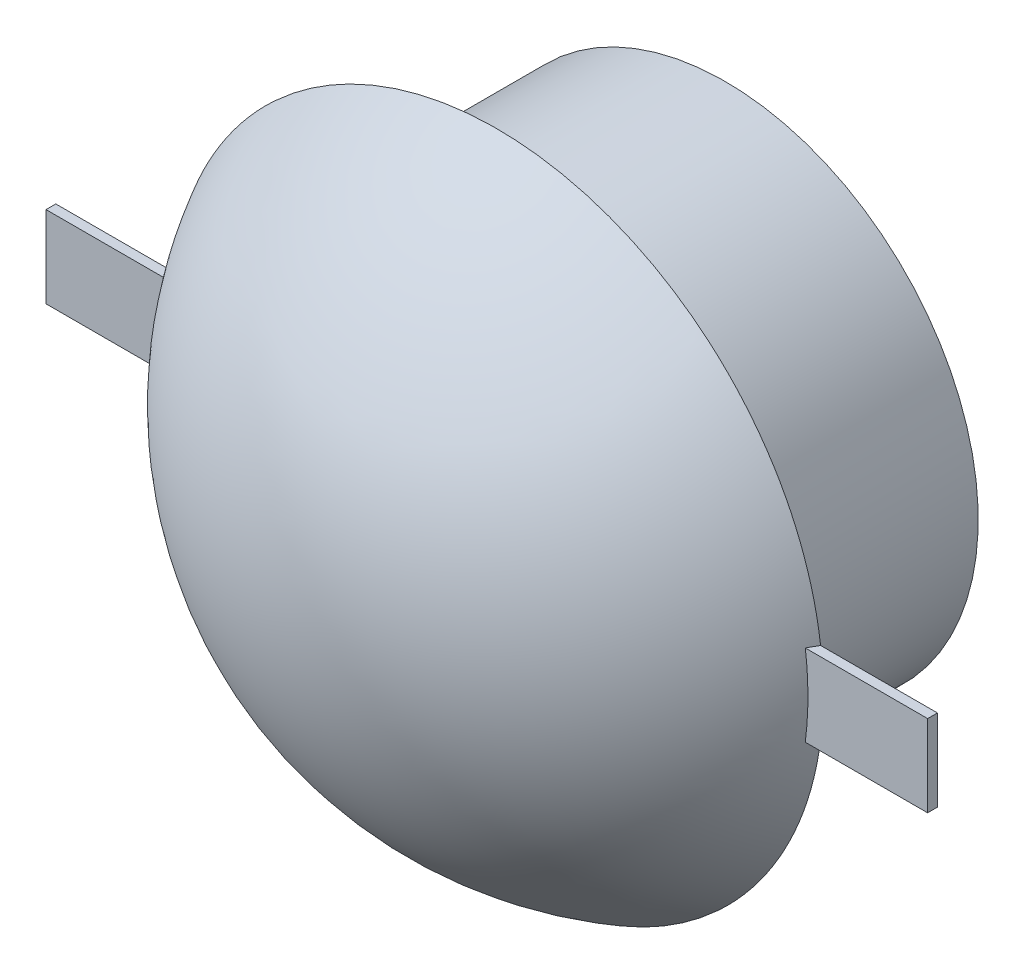
ISO-10303-21;
HEADER;
FILE_DESCRIPTION(('STEP AP214'),'2;1');
FILE_NAME('part.step','',(''),(''),'','','');
FILE_SCHEMA(('AUTOMOTIVE_DESIGN { 1 0 10303 214 1 1 1 1 }'));
ENDSEC;
DATA;
#1=APPLICATION_CONTEXT('core data for automotive mechanical design processes');
#2=APPLICATION_PROTOCOL_DEFINITION('international standard','automotive_design',2000,#1);
#3=PRODUCT_CONTEXT('',#1,'mechanical');
#4=PRODUCT('Part','Part','',(#3));
#5=PRODUCT_RELATED_PRODUCT_CATEGORY('part','',(#4));
#6=PRODUCT_DEFINITION_FORMATION('','',#4);
#7=PRODUCT_DEFINITION_CONTEXT('part definition',#1,'design');
#8=PRODUCT_DEFINITION('design','',#6,#7);
#9=PRODUCT_DEFINITION_SHAPE('','',#8);
#10=(LENGTH_UNIT() NAMED_UNIT(*) SI_UNIT(.MILLI.,.METRE.));
#11=(NAMED_UNIT(*) PLANE_ANGLE_UNIT() SI_UNIT($,.RADIAN.));
#12=(NAMED_UNIT(*) SI_UNIT($,.STERADIAN.) SOLID_ANGLE_UNIT());
#13=UNCERTAINTY_MEASURE_WITH_UNIT(LENGTH_MEASURE(1.E-05),#10,'distance_accuracy_value','');
#14=(GEOMETRIC_REPRESENTATION_CONTEXT(3) GLOBAL_UNCERTAINTY_ASSIGNED_CONTEXT((#13)) GLOBAL_UNIT_ASSIGNED_CONTEXT((#10,
#11,#12)) REPRESENTATION_CONTEXT('',''));
#15=CARTESIAN_POINT('',(0.,0.,0.));
#16=DIRECTION('',(0.,0.,1.));
#17=DIRECTION('',(1.,0.,0.));
#18=AXIS2_PLACEMENT_3D('',#15,#16,#17);
#19=CARTESIAN_POINT('',(0.,0.,7.));
#20=DIRECTION('',(0.,0.,1.));
#21=DIRECTION('',(1.,0.,0.));
#22=AXIS2_PLACEMENT_3D('',#19,#20,#21);
#23=PLANE('',#22);
#24=CARTESIAN_POINT('',(0.,0.,7.));
#25=DIRECTION('',(0.,0.,-1.));
#26=DIRECTION('',(-1.,0.,0.));
#27=AXIS2_PLACEMENT_3D('',#24,#25,#26);
#28=CIRCLE('',#27,6.95);
#29=CARTESIAN_POINT('',(-6.95,0.,7.));
#30=VERTEX_POINT('',#29);
#31=EDGE_CURVE('E21',#30,#30,#28,.T.);
#32=ORIENTED_EDGE('',*,*,#31,.T.);
#33=EDGE_LOOP('',(#32));
#34=FACE_BOUND('',#33,.T.);
#35=ADVANCED_FACE('F18',(#34),#23,.F.);
#36=CARTESIAN_POINT('',(0.,0.,7.));
#37=DIRECTION('',(0.,0.,-1.));
#38=DIRECTION('',(-1.,0.,0.));
#39=AXIS2_PLACEMENT_3D('',#36,#37,#38);
#40=CYLINDRICAL_SURFACE('',#39,6.95);
#41=CARTESIAN_POINT('',(0.,0.,0.));
#42=DIRECTION('',(0.,0.,-1.));
#43=DIRECTION('',(-1.,0.,0.));
#44=AXIS2_PLACEMENT_3D('',#41,#42,#43);
#45=CIRCLE('',#44,6.95);
#46=CARTESIAN_POINT('',(-6.95,0.,0.));
#47=VERTEX_POINT('',#46);
#48=EDGE_CURVE('E277',#47,#47,#45,.T.);
#49=ORIENTED_EDGE('',*,*,#48,.T.);
#50=EDGE_LOOP('',(#49));
#51=FACE_BOUND('',#50,.T.);
#52=ORIENTED_EDGE('',*,*,#31,.F.);
#53=EDGE_LOOP('',(#52));
#54=FACE_BOUND('',#53,.T.);
#55=ADVANCED_FACE('F265',(#51,#54),#40,.F.);
#56=CARTESIAN_POINT('',(0.,0.,0.));
#57=DIRECTION('',(0.,0.,1.));
#58=DIRECTION('',(1.,0.,0.));
#59=AXIS2_PLACEMENT_3D('',#56,#57,#58);
#60=PLANE('',#59);
#61=ORIENTED_EDGE('',*,*,#48,.F.);
#62=EDGE_LOOP('',(#61));
#63=FACE_BOUND('',#62,.T.);
#64=CARTESIAN_POINT('',(0.,0.,0.));
#65=DIRECTION('',(0.,0.,-1.));
#66=DIRECTION('',(-1.,0.,0.));
#67=AXIS2_PLACEMENT_3D('',#64,#65,#66);
#68=CIRCLE('',#67,7.75);
#69=CARTESIAN_POINT('',(-7.75,0.,0.));
#70=VERTEX_POINT('',#69);
#71=EDGE_CURVE('E218',#70,#70,#68,.F.);
#72=ORIENTED_EDGE('',*,*,#71,.F.);
#73=EDGE_LOOP('',(#72));
#74=FACE_BOUND('',#73,.T.);
#75=ADVANCED_FACE('F263',(#63,#74),#60,.F.);
#76=CARTESIAN_POINT('',(13.5,1.25,7.3));
#77=DIRECTION('',(0.,0.,1.));
#78=DIRECTION('',(1.,0.,0.));
#79=AXIS2_PLACEMENT_3D('',#76,#77,#78);
#80=PLANE('',#79);
#81=DIRECTION('',(1.,0.,0.));
#82=VECTOR('',#81,1.);
#83=CARTESIAN_POINT('',(13.5,1.25,7.3));
#84=LINE('',#83,#82);
#85=CARTESIAN_POINT('',(9.75435800040167,1.25,7.3));
#86=VERTEX_POINT('',#85);
#87=CARTESIAN_POINT('',(13.5,1.25,7.3));
#88=VERTEX_POINT('',#87);
#89=EDGE_CURVE('E175',#86,#88,#84,.T.);
#90=ORIENTED_EDGE('',*,*,#89,.F.);
#91=CARTESIAN_POINT('',(9.75435800040167,1.25,7.3));
#92=CARTESIAN_POINT('',(9.78097360314752,1.04237653603871,7.3));
#93=CARTESIAN_POINT('',(9.80094212686477,0.833902429316691,7.3));
#94=CARTESIAN_POINT('',(9.82749055253862,0.416949931410212,7.3));
#95=CARTESIAN_POINT('',(9.83412426197676,0.208474965705103,7.3));
#96=CARTESIAN_POINT('',(9.83412426197676,-0.208474965705112,7.3));
#97=CARTESIAN_POINT('',(9.82749055253862,-0.416949931410218,7.3));
#98=CARTESIAN_POINT('',(9.80094212686477,-0.833902429316695,7.3));
#99=CARTESIAN_POINT('',(9.78097360314752,-1.04237653603871,7.3));
#100=CARTESIAN_POINT('',(9.75435800040167,-1.25,7.3));
#101=B_SPLINE_CURVE_WITH_KNOTS('',3,(#91,#92,#93,#94,#95,#96,#97,#98,#99,#100),.UNSPECIFIED.,
.F.,.F.,(4,2,2,2,4),(0.,0.627858592522214,1.25317857777868,1.87849856303513,2.50635715555734),.UNSPECIFIED.);
#102=CARTESIAN_POINT('',(9.75435800040167,-1.25,7.3));
#103=VERTEX_POINT('',#102);
#104=EDGE_CURVE('E56',#86,#103,#101,.T.);
#105=ORIENTED_EDGE('',*,*,#104,.T.);
#106=DIRECTION('',(1.,0.,0.));
#107=VECTOR('',#106,1.);
#108=CARTESIAN_POINT('',(13.5,-1.25,7.3));
#109=LINE('',#108,#107);
#110=CARTESIAN_POINT('',(13.5,-1.25,7.3));
#111=VERTEX_POINT('',#110);
#112=EDGE_CURVE('E191',#111,#103,#109,.F.);
#113=ORIENTED_EDGE('',*,*,#112,.F.);
#114=DIRECTION('',(0.,1.,0.));
#115=VECTOR('',#114,1.);
#116=CARTESIAN_POINT('',(13.5,-1.25,7.3));
#117=LINE('',#116,#115);
#118=EDGE_CURVE('E188',#88,#111,#117,.F.);
#119=ORIENTED_EDGE('',*,*,#118,.F.);
#120=EDGE_LOOP('',(#90,#105,#113,#119));
#121=FACE_BOUND('',#120,.T.);
#122=ADVANCED_FACE('F204',(#121),#80,.T.);
#123=CARTESIAN_POINT('',(13.5,1.25,7.3));
#124=DIRECTION('',(0.,0.,1.));
#125=DIRECTION('',(1.,0.,0.));
#126=AXIS2_PLACEMENT_3D('',#123,#124,#125);
#127=PLANE('',#126);
#128=DIRECTION('',(1.,0.,0.));
#129=VECTOR('',#128,1.);
#130=CARTESIAN_POINT('',(13.5,-1.25,7.3));
#131=LINE('',#130,#129);
#132=CARTESIAN_POINT('',(-9.75435800040167,-1.25,7.3));
#133=VERTEX_POINT('',#132);
#134=CARTESIAN_POINT('',(-13.5,-1.25,7.3));
#135=VERTEX_POINT('',#134);
#136=EDGE_CURVE('E151',#133,#135,#131,.F.);
#137=ORIENTED_EDGE('',*,*,#136,.F.);
#138=CARTESIAN_POINT('',(-9.75435800040167,-1.25,7.3));
#139=CARTESIAN_POINT('',(-9.78097360314752,-1.04237653603871,7.3));
#140=CARTESIAN_POINT('',(-9.80094212686478,-0.833902429316693,7.3));
#141=CARTESIAN_POINT('',(-9.82749055253863,-0.416949931410214,7.3));
#142=CARTESIAN_POINT('',(-9.83412426197676,-0.208474965705106,7.3));
#143=CARTESIAN_POINT('',(-9.83412426197676,0.208474965705109,7.3));
#144=CARTESIAN_POINT('',(-9.82749055253862,0.416949931410216,7.3));
#145=CARTESIAN_POINT('',(-9.80094212686477,0.833902429316694,7.3));
#146=CARTESIAN_POINT('',(-9.78097360314752,1.04237653603871,7.3));
#147=CARTESIAN_POINT('',(-9.75435800040167,1.25,7.3));
#148=B_SPLINE_CURVE_WITH_KNOTS('',3,(#138,#139,#140,#141,#142,#143,#144,#145,#146,#147),
.UNSPECIFIED.,.F.,.F.,(4,2,2,2,4),(0.,0.627858592522213,1.25317857777867,1.87849856303513,
2.50635715555734),.UNSPECIFIED.);
#149=CARTESIAN_POINT('',(-9.75435800040167,1.25,7.3));
#150=VERTEX_POINT('',#149);
#151=EDGE_CURVE('E208',#133,#150,#148,.T.);
#152=ORIENTED_EDGE('',*,*,#151,.T.);
#153=DIRECTION('',(1.,0.,0.));
#154=VECTOR('',#153,1.);
#155=CARTESIAN_POINT('',(13.5,1.25,7.3));
#156=LINE('',#155,#154);
#157=CARTESIAN_POINT('',(-13.5,1.25,7.3));
#158=VERTEX_POINT('',#157);
#159=EDGE_CURVE('E170',#158,#150,#156,.T.);
#160=ORIENTED_EDGE('',*,*,#159,.F.);
#161=DIRECTION('',(0.,1.,0.));
#162=VECTOR('',#161,1.);
#163=CARTESIAN_POINT('',(-13.5,-1.25,7.3));
#164=LINE('',#163,#162);
#165=EDGE_CURVE('E64',#135,#158,#164,.T.);
#166=ORIENTED_EDGE('',*,*,#165,.F.);
#167=EDGE_LOOP('',(#137,#152,#160,#166));
#168=FACE_BOUND('',#167,.T.);
#169=ADVANCED_FACE('F217',(#168),#127,.T.);
#170=CARTESIAN_POINT('',(0.,0.,7.));
#171=DIRECTION('',(0.,0.,-1.));
#172=DIRECTION('',(-1.,0.,0.));
#173=AXIS2_PLACEMENT_3D('',#170,#171,#172);
#174=CYLINDRICAL_SURFACE('',#173,7.75);
#175=CARTESIAN_POINT('',(0.,0.,7.));
#176=DIRECTION('',(0.,0.,-1.));
#177=DIRECTION('',(-1.,0.,0.));
#178=AXIS2_PLACEMENT_3D('',#175,#176,#177);
#179=CIRCLE('',#178,7.75);
#180=CARTESIAN_POINT('',(-7.75,0.,7.));
#181=VERTEX_POINT('',#180);
#182=EDGE_CURVE('E127',#181,#181,#179,.T.);
#183=ORIENTED_EDGE('',*,*,#182,.T.);
#184=EDGE_LOOP('',(#183));
#185=FACE_BOUND('',#184,.T.);
#186=ORIENTED_EDGE('',*,*,#71,.T.);
#187=EDGE_LOOP('',(#186));
#188=FACE_BOUND('',#187,.T.);
#189=ADVANCED_FACE('F239',(#185,#188),#174,.T.);
#190=CARTESIAN_POINT('',(13.5,-1.25,7.3));
#191=DIRECTION('',(0.,-1.,0.));
#192=DIRECTION('',(0.,0.,-1.));
#193=AXIS2_PLACEMENT_3D('',#190,#191,#192);
#194=PLANE('',#193);
#195=DIRECTION('',(0.,0.,-1.));
#196=VECTOR('',#195,1.);
#197=CARTESIAN_POINT('',(13.5,-1.25,7.3));
#198=LINE('',#197,#196);
#199=CARTESIAN_POINT('',(13.5,-1.25,7.));
#200=VERTEX_POINT('',#199);
#201=EDGE_CURVE('E177',#111,#200,#198,.T.);
#202=ORIENTED_EDGE('',*,*,#201,.F.);
#203=ORIENTED_EDGE('',*,*,#112,.T.);
#204=CARTESIAN_POINT('',(9.75435800040167,-1.25,7.3));
#205=CARTESIAN_POINT('',(9.7829885456152,-1.25000000000001,7.25042488425317));
#206=CARTESIAN_POINT('',(9.81123793622951,-1.25000000000001,7.20063732637976));
#207=CARTESIAN_POINT('',(9.8669744082597,-1.24999999999999,7.10063732637976));
#208=CARTESIAN_POINT('',(9.89446148967557,-1.24999999999998,7.05042488425318));
#209=CARTESIAN_POINT('',(9.92156741649221,-1.24999999999996,7.00000000000001));
#210=B_SPLINE_CURVE_WITH_KNOTS('',3,(#204,#205,#206,#207,#208,#209),.UNSPECIFIED.,.F.,.F.,(4,2,
4),(0.,0.17173078029784,0.343461560595679),.UNSPECIFIED.);
#211=CARTESIAN_POINT('',(9.92156741649221,-1.24999999999998,7.));
#212=VERTEX_POINT('',#211);
#213=EDGE_CURVE('E36',#103,#212,#210,.T.);
#214=ORIENTED_EDGE('',*,*,#213,.T.);
#215=DIRECTION('',(1.,0.,0.));
#216=VECTOR('',#215,1.);
#217=CARTESIAN_POINT('',(0.,-1.25,7.));
#218=LINE('',#217,#216);
#219=EDGE_CURVE('E147',#212,#200,#218,.T.);
#220=ORIENTED_EDGE('',*,*,#219,.T.);
#221=EDGE_LOOP('',(#202,#203,#214,#220));
#222=FACE_BOUND('',#221,.T.);
#223=ADVANCED_FACE('F205',(#222),#194,.T.);
#224=CARTESIAN_POINT('',(13.5,-1.25,7.3));
#225=DIRECTION('',(1.,0.,0.));
#226=DIRECTION('',(0.,0.,-1.));
#227=AXIS2_PLACEMENT_3D('',#224,#225,#226);
#228=PLANE('',#227);
#229=ORIENTED_EDGE('',*,*,#118,.T.);
#230=ORIENTED_EDGE('',*,*,#201,.T.);
#231=DIRECTION('',(0.,1.,0.));
#232=VECTOR('',#231,1.);
#233=CARTESIAN_POINT('',(13.5,0.,7.));
#234=LINE('',#233,#232);
#235=CARTESIAN_POINT('',(13.5,1.25,7.));
#236=VERTEX_POINT('',#235);
#237=EDGE_CURVE('E99',#200,#236,#234,.T.);
#238=ORIENTED_EDGE('',*,*,#237,.T.);
#239=DIRECTION('',(0.,0.,1.));
#240=VECTOR('',#239,1.);
#241=CARTESIAN_POINT('',(13.5,1.25,7.3));
#242=LINE('',#241,#240);
#243=EDGE_CURVE('E94',#88,#236,#242,.F.);
#244=ORIENTED_EDGE('',*,*,#243,.F.);
#245=EDGE_LOOP('',(#229,#230,#238,#244));
#246=FACE_BOUND('',#245,.T.);
#247=ADVANCED_FACE('F201',(#246),#228,.T.);
#248=CARTESIAN_POINT('',(13.5,1.25,7.3));
#249=DIRECTION('',(0.,1.,0.));
#250=DIRECTION('',(0.,0.,1.));
#251=AXIS2_PLACEMENT_3D('',#248,#249,#250);
#252=PLANE('',#251);
#253=ORIENTED_EDGE('',*,*,#243,.T.);
#254=DIRECTION('',(1.,0.,0.));
#255=VECTOR('',#254,1.);
#256=CARTESIAN_POINT('',(0.,1.25,7.));
#257=LINE('',#256,#255);
#258=CARTESIAN_POINT('',(9.92156741649222,1.25,7.));
#259=VERTEX_POINT('',#258);
#260=EDGE_CURVE('E89',#236,#259,#257,.F.);
#261=ORIENTED_EDGE('',*,*,#260,.T.);
#262=CARTESIAN_POINT('',(9.75435800040167,1.25,7.3));
#263=CARTESIAN_POINT('',(9.7829885456152,1.25000000000001,7.25042488425317));
#264=CARTESIAN_POINT('',(9.81123793622951,1.25000000000001,7.20063732637976));
#265=CARTESIAN_POINT('',(9.8669744082597,1.24999999999999,7.10063732637976));
#266=CARTESIAN_POINT('',(9.89446148967557,1.24999999999997,7.05042488425318));
#267=CARTESIAN_POINT('',(9.92156741649222,1.24999999999993,7.00000000000001));
#268=B_SPLINE_CURVE_WITH_KNOTS('',3,(#262,#263,#264,#265,#266,#267),.UNSPECIFIED.,.F.,.F.,(4,2,
4),(0.,0.171730780297842,0.343461560595684),.UNSPECIFIED.);
#269=EDGE_CURVE('E92',#86,#259,#268,.T.);
#270=ORIENTED_EDGE('',*,*,#269,.F.);
#271=ORIENTED_EDGE('',*,*,#89,.T.);
#272=EDGE_LOOP('',(#253,#261,#270,#271));
#273=FACE_BOUND('',#272,.T.);
#274=ADVANCED_FACE('F90',(#273),#252,.T.);
#275=CARTESIAN_POINT('',(13.5,1.25,7.3));
#276=DIRECTION('',(0.,1.,0.));
#277=DIRECTION('',(0.,0.,1.));
#278=AXIS2_PLACEMENT_3D('',#275,#276,#277);
#279=PLANE('',#278);
#280=DIRECTION('',(0.,0.,1.));
#281=VECTOR('',#280,1.);
#282=CARTESIAN_POINT('',(-13.5,1.25,7.3));
#283=LINE('',#282,#281);
#284=CARTESIAN_POINT('',(-13.5,1.25,7.));
#285=VERTEX_POINT('',#284);
#286=EDGE_CURVE('E165',#158,#285,#283,.F.);
#287=ORIENTED_EDGE('',*,*,#286,.F.);
#288=ORIENTED_EDGE('',*,*,#159,.T.);
#289=CARTESIAN_POINT('',(-9.92156741649221,1.25,7.));
#290=CARTESIAN_POINT('',(-9.89446148967557,1.25000000000002,7.05042488425317));
#291=CARTESIAN_POINT('',(-9.8669744082597,1.25000000000002,7.10063732637976));
#292=CARTESIAN_POINT('',(-9.81123793622952,1.24999999999998,7.20063732637976));
#293=CARTESIAN_POINT('',(-9.78298854561521,1.24999999999994,7.25042488425318));
#294=CARTESIAN_POINT('',(-9.75435800040167,1.24999999999988,7.30000000000001));
#295=B_SPLINE_CURVE_WITH_KNOTS('',3,(#289,#290,#291,#292,#293,#294),.UNSPECIFIED.,.F.,.F.,(4,2,
4),(0.,0.171730780297844,0.34346156059569),.UNSPECIFIED.);
#296=CARTESIAN_POINT('',(-9.92156741649221,1.25,7.));
#297=VERTEX_POINT('',#296);
#298=EDGE_CURVE('E105',#297,#150,#295,.T.);
#299=ORIENTED_EDGE('',*,*,#298,.F.);
#300=DIRECTION('',(1.,0.,0.));
#301=VECTOR('',#300,1.);
#302=CARTESIAN_POINT('',(0.,1.25,7.));
#303=LINE('',#302,#301);
#304=EDGE_CURVE('E113',#297,#285,#303,.F.);
#305=ORIENTED_EDGE('',*,*,#304,.T.);
#306=EDGE_LOOP('',(#287,#288,#299,#305));
#307=FACE_BOUND('',#306,.T.);
#308=ADVANCED_FACE('F215',(#307),#279,.T.);
#309=CARTESIAN_POINT('',(-13.5,-1.25,7.3));
#310=DIRECTION('',(-1.,0.,0.));
#311=DIRECTION('',(0.,0.,1.));
#312=AXIS2_PLACEMENT_3D('',#309,#310,#311);
#313=PLANE('',#312);
#314=ORIENTED_EDGE('',*,*,#165,.T.);
#315=ORIENTED_EDGE('',*,*,#286,.T.);
#316=DIRECTION('',(0.,1.,0.));
#317=VECTOR('',#316,1.);
#318=CARTESIAN_POINT('',(-13.5,0.,7.));
#319=LINE('',#318,#317);
#320=CARTESIAN_POINT('',(-13.5,-1.25,7.));
#321=VERTEX_POINT('',#320);
#322=EDGE_CURVE('E115',#285,#321,#319,.F.);
#323=ORIENTED_EDGE('',*,*,#322,.T.);
#324=DIRECTION('',(0.,0.,-1.));
#325=VECTOR('',#324,1.);
#326=CARTESIAN_POINT('',(-13.5,-1.25,7.3));
#327=LINE('',#326,#325);
#328=EDGE_CURVE('E106',#135,#321,#327,.T.);
#329=ORIENTED_EDGE('',*,*,#328,.F.);
#330=EDGE_LOOP('',(#314,#315,#323,#329));
#331=FACE_BOUND('',#330,.T.);
#332=ADVANCED_FACE('F216',(#331),#313,.T.);
#333=CARTESIAN_POINT('',(13.5,-1.25,7.3));
#334=DIRECTION('',(0.,-1.,0.));
#335=DIRECTION('',(0.,0.,-1.));
#336=AXIS2_PLACEMENT_3D('',#333,#334,#335);
#337=PLANE('',#336);
#338=ORIENTED_EDGE('',*,*,#328,.T.);
#339=DIRECTION('',(1.,0.,0.));
#340=VECTOR('',#339,1.);
#341=CARTESIAN_POINT('',(0.,-1.25,7.));
#342=LINE('',#341,#340);
#343=CARTESIAN_POINT('',(-9.92156741649221,-1.25,7.));
#344=VERTEX_POINT('',#343);
#345=EDGE_CURVE('E27',#321,#344,#342,.T.);
#346=ORIENTED_EDGE('',*,*,#345,.T.);
#347=CARTESIAN_POINT('',(-9.92156741649221,-1.25,7.));
#348=CARTESIAN_POINT('',(-9.89446148967557,-1.25000000000001,7.05042488425317));
#349=CARTESIAN_POINT('',(-9.8669744082597,-1.25000000000001,7.10063732637976));
#350=CARTESIAN_POINT('',(-9.81123793622952,-1.24999999999999,7.20063732637976));
#351=CARTESIAN_POINT('',(-9.78298854561521,-1.24999999999997,7.25042488425318));
#352=CARTESIAN_POINT('',(-9.75435800040167,-1.24999999999994,7.30000000000001));
#353=B_SPLINE_CURVE_WITH_KNOTS('',3,(#347,#348,#349,#350,#351,#352),.UNSPECIFIED.,.F.,.F.,(4,2,
4),(0.,0.171730780297845,0.34346156059569),.UNSPECIFIED.);
#354=EDGE_CURVE('E154',#344,#133,#353,.T.);
#355=ORIENTED_EDGE('',*,*,#354,.T.);
#356=ORIENTED_EDGE('',*,*,#136,.T.);
#357=EDGE_LOOP('',(#338,#346,#355,#356));
#358=FACE_BOUND('',#357,.T.);
#359=ADVANCED_FACE('F211',(#358),#337,.T.);
#360=CARTESIAN_POINT('',(0.,0.,7.));
#361=DIRECTION('',(0.,0.,1.));
#362=DIRECTION('',(1.,0.,0.));
#363=AXIS2_PLACEMENT_3D('',#360,#361,#362);
#364=PLANE('',#363);
#365=ORIENTED_EDGE('',*,*,#345,.F.);
#366=ORIENTED_EDGE('',*,*,#322,.F.);
#367=ORIENTED_EDGE('',*,*,#304,.F.);
#368=CARTESIAN_POINT('',(9.92156741649222,1.25,7.));
#369=CARTESIAN_POINT('',(9.88644076121411,1.52905110305428,7.));
#370=CARTESIAN_POINT('',(9.83948345792554,1.80660730034414,7.));
#371=CARTESIAN_POINT('',(9.72237468583968,2.35676945625605,7.));
#372=CARTESIAN_POINT('',(9.65222432773794,2.6293756512701,7.));
#373=CARTESIAN_POINT('',(9.48925048588958,3.16751506162331,7.));
#374=CARTESIAN_POINT('',(9.39644299187236,3.43305311919981,7.));
#375=CARTESIAN_POINT('',(9.18879940232547,3.95536789988443,7.));
#376=CARTESIAN_POINT('',(9.07396357449392,4.21214472941823,7.));
#377=CARTESIAN_POINT('',(8.82301671469031,4.71523431198505,7.));
#378=CARTESIAN_POINT('',(8.68689568440994,4.96154207787487,7.));
#379=CARTESIAN_POINT('',(8.39438615348834,5.44181366818642,7.));
#380=CARTESIAN_POINT('',(8.23799765037597,5.67577749110309,7.));
#381=CARTESIAN_POINT('',(7.90609723630146,6.12965347489034,7.));
#382=CARTESIAN_POINT('',(7.73058903592003,6.34956834916002,7.));
#383=CARTESIAN_POINT('',(7.36167287530993,6.77383175917333,7.));
#384=CARTESIAN_POINT('',(7.16826499655467,6.97818036576174,6.99999999999999));
#385=CARTESIAN_POINT('',(6.76491866728229,7.36986455296616,6.99999999999999));
#386=CARTESIAN_POINT('',(6.55497981864729,7.55719972361089,7.));
#387=CARTESIAN_POINT('',(6.12006756065798,7.91352016696724,7.));
#388=CARTESIAN_POINT('',(5.89509412487254,8.0825054074179,7.));
#389=CARTESIAN_POINT('',(5.43167742371946,8.40094830495005,7.));
#390=CARTESIAN_POINT('',(5.19323214383007,8.55040303039314,7.));
#391=CARTESIAN_POINT('',(4.70459807041957,8.82869237328929,7.));
#392=CARTESIAN_POINT('',(4.45440928216911,8.95752699999686,7.));
#393=CARTESIAN_POINT('',(3.94407871618772,9.19365476157506,7.));
#394=CARTESIAN_POINT('',(3.68393739370228,9.30094888034518,7.));
#395=CARTESIAN_POINT('',(3.15554053710994,9.49324015867245,7.));
#396=CARTESIAN_POINT('',(2.88728500253421,9.57823731694131,7.));
#397=CARTESIAN_POINT('',(2.34458296421238,9.72532602195556,7.));
#398=CARTESIAN_POINT('',(2.07013682542539,9.78741891526683,7.));
#399=CARTESIAN_POINT('',(1.51698938437996,9.88826469561,7.));
#400=CARTESIAN_POINT('',(1.23828808238971,9.92701758411308,6.99999999999999));
#401=CARTESIAN_POINT('',(0.678605138696108,9.98090848514379,6.99999999999999));
#402=CARTESIAN_POINT('',(0.397623444671709,9.99604595429369,7.));
#403=CARTESIAN_POINT('',(-0.164616370500597,10.0025966922407,7.));
#404=CARTESIAN_POINT('',(-0.445874491663639,9.99400995973885,7.));
#405=CARTESIAN_POINT('',(-1.00667118770499,9.95317307570154,7.));
#406=CARTESIAN_POINT('',(-1.28620974054046,9.92092262145987,7.));
#407=CARTESIAN_POINT('',(-1.84157627409385,9.83298723575724,7.));
#408=CARTESIAN_POINT('',(-2.11740425498477,9.77730230538901,7.));
#409=CARTESIAN_POINT('',(-2.6633875230083,9.64289413994788,7.));
#410=CARTESIAN_POINT('',(-2.93354283378385,9.56417100091566,7.));
#411=CARTESIAN_POINT('',(-3.46626135702079,9.38424598625646,7.));
#412=CARTESIAN_POINT('',(-3.72882456779592,9.28304410563682,7.));
#413=CARTESIAN_POINT('',(-4.24449106407945,9.05888157937492,7.));
#414=CARTESIAN_POINT('',(-4.49759438940886,8.93592102533744,7.));
#415=CARTESIAN_POINT('',(-4.99254261383123,8.66911517627692,7.));
#416=CARTESIAN_POINT('',(-5.23438752497808,8.5252699036149,7.));
#417=CARTESIAN_POINT('',(-5.70508580167798,8.2177263436421,7.));
#418=CARTESIAN_POINT('',(-5.93393994081819,8.05402924031204,7.));
#419=CARTESIAN_POINT('',(-6.3770501778334,7.7079351773229,7.));
#420=CARTESIAN_POINT('',(-6.59130596427917,7.52553781893576,7.));
#421=CARTESIAN_POINT('',(-7.00371215649562,7.14332315581632,7.));
#422=CARTESIAN_POINT('',(-7.20186091294363,6.94350407147056,7.));
#423=CARTESIAN_POINT('',(-7.58061616117369,6.52788678299576,7.));
#424=CARTESIAN_POINT('',(-7.76122298002511,6.31208887692406,6.99999999999999));
#425=CARTESIAN_POINT('',(-8.10367220209947,5.86596929621438,6.99999999999999));
#426=CARTESIAN_POINT('',(-8.26550827145463,5.63564275937916,7.));
#427=CARTESIAN_POINT('',(-8.56919088957233,5.16217665760711,7.));
#428=CARTESIAN_POINT('',(-8.71103782568833,4.9190373410844,7.));
#429=CARTESIAN_POINT('',(-8.97366226657259,4.42180751819907,7.));
#430=CARTESIAN_POINT('',(-9.09445189543083,4.16772341927883,7.));
#431=CARTESIAN_POINT('',(-9.31416492001269,3.65038549107306,7.));
#432=CARTESIAN_POINT('',(-9.41309490645684,3.38713445342156,7.));
#433=CARTESIAN_POINT('',(-9.60069303225629,2.81588009431553,7.));
#434=CARTESIAN_POINT('',(-9.6860005506458,2.50675971108342,7.));
#435=CARTESIAN_POINT('',(-9.79134960483228,2.03839832022175,7.));
#436=CARTESIAN_POINT('',(-9.82268287897993,1.88161173625665,7.));
#437=CARTESIAN_POINT('',(-9.87779975232775,1.56671888800431,7.));
#438=CARTESIAN_POINT('',(-9.90158343517212,1.40861263835797,7.));
#439=CARTESIAN_POINT('',(-9.92156741649221,1.25,7.));
#440=B_SPLINE_CURVE_WITH_KNOTS('',3,(#368,#369,#370,#371,#372,#373,#374,#375,#376,#377,#378,
#379,#380,#381,#382,#383,#384,#385,#386,#387,#388,#389,#390,#391,#392,#393,#394,#395,#396,#397,
#398,#399,#400,#401,#402,#403,#404,#405,#406,#407,#408,#409,#410,#411,#412,#413,#414,#415,#416,
#417,#418,#419,#420,#421,#422,#423,#424,#425,#426,#427,#428,#429,#430,#431,#432,#433,#434,#435,
#436,#437,#438,#439),.UNSPECIFIED.,.F.,.F.,(4,2,2,2,2,2,2,2,2,2,2,2,2,2,2,2,2,2,2,2,2,2,2,2,2,2,
2,2,2,2,2,2,2,2,2,4),(0.,0.843502253568795,1.68696411838593,2.52983244231568,3.37269052398286,
4.21594571773415,5.05920101430046,5.9022929499438,6.74538104830095,7.58848945709109,
8.43159934812298,9.27483564960116,10.118071572626,10.961268970643,11.8044664173793,
12.6476142837453,13.4907620969655,14.3339293102642,15.1770965697305,16.0202746151771,
16.8634526213075,17.7066271124845,18.5498017909356,19.3929729196761,20.2361431456496,
21.0792631089139,21.9224010529775,22.7656252239479,23.6088336699876,24.4523258195681,
25.295801621539,26.1387901629071,26.9815241938914,27.9419062026271,28.4214105320112,
28.9009095486368),.UNSPECIFIED.);
#441=EDGE_CURVE('E98',#259,#297,#440,.T.);
#442=ORIENTED_EDGE('',*,*,#441,.F.);
#443=ORIENTED_EDGE('',*,*,#260,.F.);
#444=ORIENTED_EDGE('',*,*,#237,.F.);
#445=ORIENTED_EDGE('',*,*,#219,.F.);
#446=CARTESIAN_POINT('',(-9.92156741649221,-1.25,7.));
#447=CARTESIAN_POINT('',(-9.88644076121411,-1.52905110305427,7.));
#448=CARTESIAN_POINT('',(-9.83948345792554,-1.80660730034414,7.));
#449=CARTESIAN_POINT('',(-9.72237468583968,-2.35676945625605,7.));
#450=CARTESIAN_POINT('',(-9.65222432773795,-2.6293756512701,7.));
#451=CARTESIAN_POINT('',(-9.48925048588958,-3.16751506162331,7.));
#452=CARTESIAN_POINT('',(-9.39644299187237,-3.43305311919981,7.));
#453=CARTESIAN_POINT('',(-9.18879940232547,-3.95536789988443,7.));
#454=CARTESIAN_POINT('',(-9.07396357449392,-4.21214472941822,6.99999999999999));
#455=CARTESIAN_POINT('',(-8.82301671469032,-4.71523431198504,6.99999999999999));
#456=CARTESIAN_POINT('',(-8.68689568440994,-4.96154207787487,7.));
#457=CARTESIAN_POINT('',(-8.39438615348834,-5.44181366818642,7.));
#458=CARTESIAN_POINT('',(-8.23799765037598,-5.67577749110308,7.));
#459=CARTESIAN_POINT('',(-7.90609723630147,-6.12965347489034,7.));
#460=CARTESIAN_POINT('',(-7.73058903592003,-6.34956834916002,7.));
#461=CARTESIAN_POINT('',(-7.36167287530993,-6.77383175917333,7.));
#462=CARTESIAN_POINT('',(-7.16826499655467,-6.97818036576173,7.));
#463=CARTESIAN_POINT('',(-6.76491866728229,-7.36986455296616,7.));
#464=CARTESIAN_POINT('',(-6.5549798186473,-7.55719972361089,7.));
#465=CARTESIAN_POINT('',(-6.12006756065799,-7.91352016696723,7.));
#466=CARTESIAN_POINT('',(-5.89509412487255,-8.0825054074179,7.));
#467=CARTESIAN_POINT('',(-5.43167742371946,-8.40094830495005,7.));
#468=CARTESIAN_POINT('',(-5.19323214383008,-8.55040303039313,7.));
#469=CARTESIAN_POINT('',(-4.70459807041957,-8.82869237328929,7.));
#470=CARTESIAN_POINT('',(-4.45440928216911,-8.95752699999685,7.));
#471=CARTESIAN_POINT('',(-3.94407871618772,-9.19365476157506,7.));
#472=CARTESIAN_POINT('',(-3.68393739370229,-9.30094888034517,7.));
#473=CARTESIAN_POINT('',(-3.15554053710995,-9.49324015867245,7.));
#474=CARTESIAN_POINT('',(-2.88728500253422,-9.5782373169413,7.));
#475=CARTESIAN_POINT('',(-2.34458296421238,-9.72532602195556,7.));
#476=CARTESIAN_POINT('',(-2.0701368254254,-9.78741891526683,7.));
#477=CARTESIAN_POINT('',(-1.51698938437996,-9.88826469561,7.));
#478=CARTESIAN_POINT('',(-1.23828808238972,-9.92701758411308,7.));
#479=CARTESIAN_POINT('',(-0.678605138696112,-9.98090848514379,7.));
#480=CARTESIAN_POINT('',(-0.397623444671714,-9.99604595429369,7.));
#481=CARTESIAN_POINT('',(0.164616370500592,-10.0025966922407,7.));
#482=CARTESIAN_POINT('',(0.445874491663634,-9.99400995973884,7.));
#483=CARTESIAN_POINT('',(1.00667118770499,-9.95317307570154,7.));
#484=CARTESIAN_POINT('',(1.28620974054046,-9.92092262145987,7.));
#485=CARTESIAN_POINT('',(1.84157627409384,-9.83298723575724,7.));
#486=CARTESIAN_POINT('',(2.11740425498477,-9.777302305389,7.));
#487=CARTESIAN_POINT('',(2.6633875230083,-9.64289413994788,7.));
#488=CARTESIAN_POINT('',(2.93354283378385,-9.56417100091567,7.));
#489=CARTESIAN_POINT('',(3.46626135702079,-9.38424598625646,7.));
#490=CARTESIAN_POINT('',(3.72882456779592,-9.28304410563682,7.));
#491=CARTESIAN_POINT('',(4.24449106407944,-9.05888157937492,7.));
#492=CARTESIAN_POINT('',(4.49759438940885,-8.93592102533744,7.));
#493=CARTESIAN_POINT('',(4.99254261383122,-8.66911517627692,7.));
#494=CARTESIAN_POINT('',(5.23438752497807,-8.5252699036149,7.));
#495=CARTESIAN_POINT('',(5.70508580167798,-8.2177263436421,7.));
#496=CARTESIAN_POINT('',(5.93393994081819,-8.05402924031204,7.));
#497=CARTESIAN_POINT('',(6.3770501778334,-7.7079351773229,7.));
#498=CARTESIAN_POINT('',(6.59130596427917,-7.52553781893576,7.));
#499=CARTESIAN_POINT('',(7.00371215649562,-7.14332315581632,7.));
#500=CARTESIAN_POINT('',(7.20186091294363,-6.94350407147056,7.));
#501=CARTESIAN_POINT('',(7.58061616117369,-6.52788678299576,7.));
#502=CARTESIAN_POINT('',(7.7612229800251,-6.31208887692406,6.99999999999999));
#503=CARTESIAN_POINT('',(8.10367220209947,-5.86596929621438,6.99999999999999));
#504=CARTESIAN_POINT('',(8.26550827145463,-5.63564275937916,7.));
#505=CARTESIAN_POINT('',(8.56919088957232,-5.16217665760711,7.));
#506=CARTESIAN_POINT('',(8.71103782568833,-4.9190373410844,7.));
#507=CARTESIAN_POINT('',(8.97366226657259,-4.42180751819907,7.));
#508=CARTESIAN_POINT('',(9.09445189543083,-4.16772341927883,7.));
#509=CARTESIAN_POINT('',(9.31416492001269,-3.65038549107306,7.));
#510=CARTESIAN_POINT('',(9.41309490645684,-3.38713445342156,7.));
#511=CARTESIAN_POINT('',(9.60069303225629,-2.81588009431553,7.));
#512=CARTESIAN_POINT('',(9.68600055064579,-2.50675971108341,7.));
#513=CARTESIAN_POINT('',(9.79134960483228,-2.03839832022175,7.));
#514=CARTESIAN_POINT('',(9.82268287897993,-1.88161173625665,7.));
#515=CARTESIAN_POINT('',(9.87779975232775,-1.56671888800431,7.));
#516=CARTESIAN_POINT('',(9.90158343517212,-1.40861263835796,7.));
#517=CARTESIAN_POINT('',(9.92156741649221,-1.25,7.));
#518=B_SPLINE_CURVE_WITH_KNOTS('',3,(#446,#447,#448,#449,#450,#451,#452,#453,#454,#455,#456,
#457,#458,#459,#460,#461,#462,#463,#464,#465,#466,#467,#468,#469,#470,#471,#472,#473,#474,#475,
#476,#477,#478,#479,#480,#481,#482,#483,#484,#485,#486,#487,#488,#489,#490,#491,#492,#493,#494,
#495,#496,#497,#498,#499,#500,#501,#502,#503,#504,#505,#506,#507,#508,#509,#510,#511,#512,#513,
#514,#515,#516,#517),.UNSPECIFIED.,.F.,.F.,(4,2,2,2,2,2,2,2,2,2,2,2,2,2,2,2,2,2,2,2,2,2,2,2,2,2,
2,2,2,2,2,2,2,2,2,4),(0.,0.843502253568794,1.68696411838593,2.52983244231568,3.37269052398286,
4.21594571773415,5.05920101430046,5.9022929499438,6.74538104830095,7.58848945709109,
8.43159934812297,9.27483564960115,10.118071572626,10.961268970643,11.8044664173793,
12.6476142837453,13.4907620969655,14.3339293102642,15.1770965697305,16.0202746151771,
16.8634526213075,17.7066271124845,18.5498017909356,19.3929729196761,20.2361431456496,
21.0792631089139,21.9224010529775,22.7656252239479,23.6088336699876,24.4523258195681,
25.295801621539,26.1387901629071,26.9815241938915,27.9419062026271,28.4214105320112,
28.9009095486368),.UNSPECIFIED.);
#519=EDGE_CURVE('E11',#344,#212,#518,.T.);
#520=ORIENTED_EDGE('',*,*,#519,.F.);
#521=EDGE_LOOP('',(#365,#366,#367,#442,#443,#444,#445,#520));
#522=FACE_BOUND('',#521,.T.);
#523=ORIENTED_EDGE('',*,*,#182,.F.);
#524=EDGE_LOOP('',(#523));
#525=FACE_BOUND('',#524,.T.);
#526=ADVANCED_FACE('F109',(#522,#525),#364,.F.);
#527=CARTESIAN_POINT('',(0.,0.,1.66666666666666));
#528=DIRECTION('',(1.,0.,0.));
#529=DIRECTION('',(0.,0.,1.));
#530=AXIS2_PLACEMENT_3D('',#527,#528,#529);
#531=SPHERICAL_SURFACE('',#530,11.3333333333333);
#532=ORIENTED_EDGE('',*,*,#213,.F.);
#533=ORIENTED_EDGE('',*,*,#104,.F.);
#534=ORIENTED_EDGE('',*,*,#269,.T.);
#535=ORIENTED_EDGE('',*,*,#441,.T.);
#536=ORIENTED_EDGE('',*,*,#298,.T.);
#537=ORIENTED_EDGE('',*,*,#151,.F.);
#538=ORIENTED_EDGE('',*,*,#354,.F.);
#539=ORIENTED_EDGE('',*,*,#519,.T.);
#540=EDGE_LOOP('',(#532,#533,#534,#535,#536,#537,#538,#539));
#541=FACE_BOUND('',#540,.T.);
#542=ADVANCED_FACE('F102',(#541),#531,.T.);
#543=CLOSED_SHELL('',(#35,#55,#75,#122,#169,#189,#223,#247,#274,#308,#332,#359,#526,#542));
#544=MANIFOLD_SOLID_BREP('B1',#543);
#545=ADVANCED_BREP_SHAPE_REPRESENTATION('',(#18,#544),#14);
#546=SHAPE_DEFINITION_REPRESENTATION(#9,#545);
ENDSEC;
END-ISO-10303-21;
